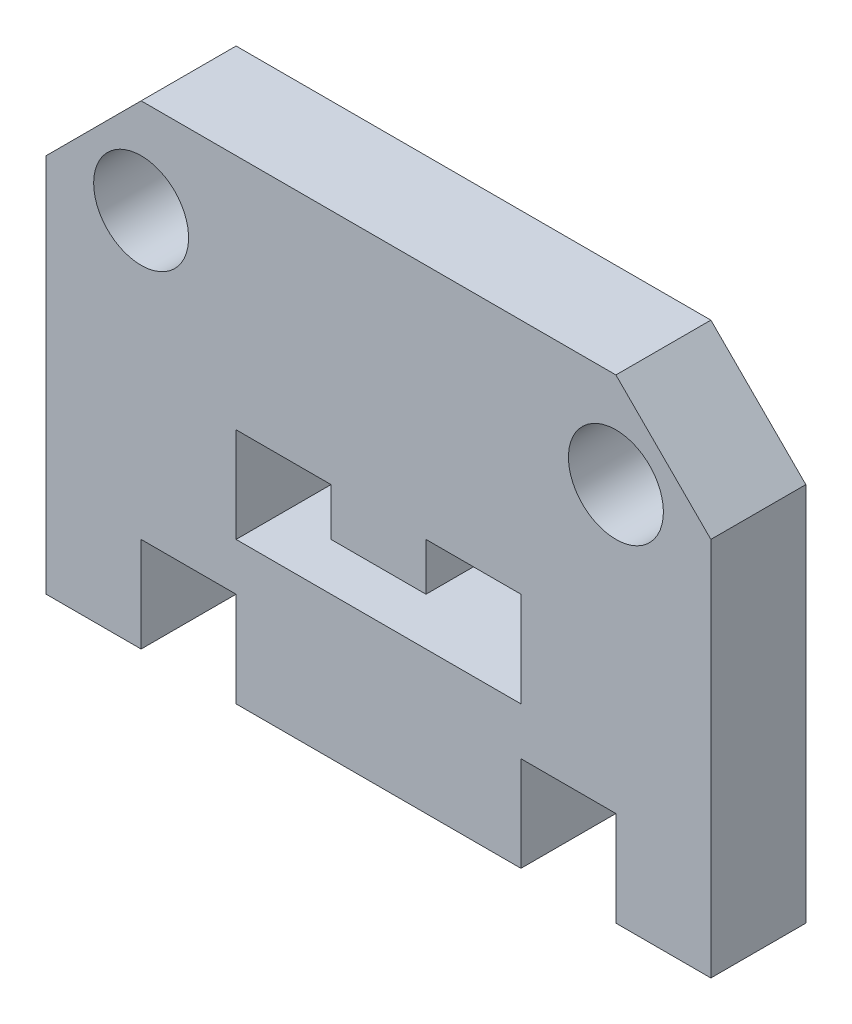
ISO-10303-21;
HEADER;
FILE_DESCRIPTION(('STEP AP214'),'2;1');
FILE_NAME('part.step','',(''),(''),'','','');
FILE_SCHEMA(('AUTOMOTIVE_DESIGN { 1 0 10303 214 1 1 1 1 }'));
ENDSEC;
DATA;
#1=APPLICATION_CONTEXT('core data for automotive mechanical design processes');
#2=APPLICATION_PROTOCOL_DEFINITION('international standard','automotive_design',2000,#1);
#3=PRODUCT_CONTEXT('',#1,'mechanical');
#4=PRODUCT('Part','Part','',(#3));
#5=PRODUCT_RELATED_PRODUCT_CATEGORY('part','',(#4));
#6=PRODUCT_DEFINITION_FORMATION('','',#4);
#7=PRODUCT_DEFINITION_CONTEXT('part definition',#1,'design');
#8=PRODUCT_DEFINITION('design','',#6,#7);
#9=PRODUCT_DEFINITION_SHAPE('','',#8);
#10=(LENGTH_UNIT() NAMED_UNIT(*) SI_UNIT(.MILLI.,.METRE.));
#11=(NAMED_UNIT(*) PLANE_ANGLE_UNIT() SI_UNIT($,.RADIAN.));
#12=(NAMED_UNIT(*) SI_UNIT($,.STERADIAN.) SOLID_ANGLE_UNIT());
#13=UNCERTAINTY_MEASURE_WITH_UNIT(LENGTH_MEASURE(1.E-05),#10,'distance_accuracy_value','');
#14=(GEOMETRIC_REPRESENTATION_CONTEXT(3) GLOBAL_UNCERTAINTY_ASSIGNED_CONTEXT((#13)) GLOBAL_UNIT_ASSIGNED_CONTEXT((#10,
#11,#12)) REPRESENTATION_CONTEXT('',''));
#15=CARTESIAN_POINT('',(0.,0.,0.));
#16=DIRECTION('',(0.,0.,1.));
#17=DIRECTION('',(1.,0.,0.));
#18=AXIS2_PLACEMENT_3D('',#15,#16,#17);
#19=CARTESIAN_POINT('',(0.,0.,10.));
#20=DIRECTION('',(0.,0.,1.));
#21=DIRECTION('',(1.,0.,0.));
#22=AXIS2_PLACEMENT_3D('',#19,#20,#21);
#23=PLANE('',#22);
#24=CARTESIAN_POINT('',(25.,40.,10.));
#25=DIRECTION('',(0.,0.,1.));
#26=DIRECTION('',(1.,0.,0.));
#27=AXIS2_PLACEMENT_3D('',#24,#25,#26);
#28=CIRCLE('',#27,5.);
#29=CARTESIAN_POINT('',(30.,40.,10.));
#30=VERTEX_POINT('',#29);
#31=EDGE_CURVE('E220',#30,#30,#28,.T.);
#32=ORIENTED_EDGE('',*,*,#31,.F.);
#33=EDGE_LOOP('',(#32));
#34=FACE_BOUND('',#33,.T.);
#35=DIRECTION('',(1.,0.,0.));
#36=VECTOR('',#35,1.);
#37=CARTESIAN_POINT('',(-15.,10.,10.));
#38=LINE('',#37,#36);
#39=CARTESIAN_POINT('',(-25.,10.,10.));
#40=VERTEX_POINT('',#39);
#41=CARTESIAN_POINT('',(-15.,10.,10.));
#42=VERTEX_POINT('',#41);
#43=EDGE_CURVE('E250',#40,#42,#38,.T.);
#44=ORIENTED_EDGE('',*,*,#43,.T.);
#45=DIRECTION('',(0.,-1.,0.));
#46=VECTOR('',#45,1.);
#47=CARTESIAN_POINT('',(-15.,0.,10.));
#48=LINE('',#47,#46);
#49=CARTESIAN_POINT('',(-15.,0.,10.));
#50=VERTEX_POINT('',#49);
#51=EDGE_CURVE('E253',#42,#50,#48,.T.);
#52=ORIENTED_EDGE('',*,*,#51,.T.);
#53=DIRECTION('',(1.,0.,0.));
#54=VECTOR('',#53,1.);
#55=CARTESIAN_POINT('',(-15.,0.,10.));
#56=LINE('',#55,#54);
#57=CARTESIAN_POINT('',(15.,0.,10.));
#58=VERTEX_POINT('',#57);
#59=EDGE_CURVE('E256',#50,#58,#56,.T.);
#60=ORIENTED_EDGE('',*,*,#59,.T.);
#61=DIRECTION('',(0.,1.,0.));
#62=VECTOR('',#61,1.);
#63=CARTESIAN_POINT('',(15.,0.,10.));
#64=LINE('',#63,#62);
#65=CARTESIAN_POINT('',(15.,10.,10.));
#66=VERTEX_POINT('',#65);
#67=EDGE_CURVE('E258',#58,#66,#64,.T.);
#68=ORIENTED_EDGE('',*,*,#67,.T.);
#69=DIRECTION('',(1.,0.,0.));
#70=VECTOR('',#69,1.);
#71=CARTESIAN_POINT('',(15.,10.,10.));
#72=LINE('',#71,#70);
#73=CARTESIAN_POINT('',(25.,10.,10.));
#74=VERTEX_POINT('',#73);
#75=EDGE_CURVE('E260',#66,#74,#72,.T.);
#76=ORIENTED_EDGE('',*,*,#75,.T.);
#77=DIRECTION('',(0.,-1.,0.));
#78=VECTOR('',#77,1.);
#79=CARTESIAN_POINT('',(25.,10.,10.));
#80=LINE('',#79,#78);
#81=CARTESIAN_POINT('',(25.,0.,10.));
#82=VERTEX_POINT('',#81);
#83=EDGE_CURVE('E262',#74,#82,#80,.T.);
#84=ORIENTED_EDGE('',*,*,#83,.T.);
#85=DIRECTION('',(1.,0.,0.));
#86=VECTOR('',#85,1.);
#87=CARTESIAN_POINT('',(25.,0.,10.));
#88=LINE('',#87,#86);
#89=CARTESIAN_POINT('',(35.,0.,10.));
#90=VERTEX_POINT('',#89);
#91=EDGE_CURVE('E264',#82,#90,#88,.T.);
#92=ORIENTED_EDGE('',*,*,#91,.T.);
#93=DIRECTION('',(0.,1.,0.));
#94=VECTOR('',#93,1.);
#95=CARTESIAN_POINT('',(35.,0.,10.));
#96=LINE('',#95,#94);
#97=CARTESIAN_POINT('',(35.,40.,10.));
#98=VERTEX_POINT('',#97);
#99=EDGE_CURVE('E266',#90,#98,#96,.T.);
#100=ORIENTED_EDGE('',*,*,#99,.T.);
#101=DIRECTION('',(-0.707106781186549,0.707106781186546,0.));
#102=VECTOR('',#101,1.);
#103=CARTESIAN_POINT('',(35.,40.,10.));
#104=LINE('',#103,#102);
#105=CARTESIAN_POINT('',(25.,50.,10.));
#106=VERTEX_POINT('',#105);
#107=EDGE_CURVE('E268',#98,#106,#104,.T.);
#108=ORIENTED_EDGE('',*,*,#107,.T.);
#109=DIRECTION('',(-1.,0.,0.));
#110=VECTOR('',#109,1.);
#111=CARTESIAN_POINT('',(25.,50.,10.));
#112=LINE('',#111,#110);
#113=CARTESIAN_POINT('',(-25.,50.,10.));
#114=VERTEX_POINT('',#113);
#115=EDGE_CURVE('E270',#106,#114,#112,.T.);
#116=ORIENTED_EDGE('',*,*,#115,.T.);
#117=DIRECTION('',(-0.707106781186549,-0.707106781186546,0.));
#118=VECTOR('',#117,1.);
#119=CARTESIAN_POINT('',(-35.,40.,10.));
#120=LINE('',#119,#118);
#121=CARTESIAN_POINT('',(-35.,40.,10.));
#122=VERTEX_POINT('',#121);
#123=EDGE_CURVE('E272',#114,#122,#120,.T.);
#124=ORIENTED_EDGE('',*,*,#123,.T.);
#125=DIRECTION('',(0.,-1.,0.));
#126=VECTOR('',#125,1.);
#127=CARTESIAN_POINT('',(-35.,0.,10.));
#128=LINE('',#127,#126);
#129=CARTESIAN_POINT('',(-35.,0.,10.));
#130=VERTEX_POINT('',#129);
#131=EDGE_CURVE('E274',#122,#130,#128,.T.);
#132=ORIENTED_EDGE('',*,*,#131,.T.);
#133=DIRECTION('',(1.,0.,0.));
#134=VECTOR('',#133,1.);
#135=CARTESIAN_POINT('',(-25.,0.,10.));
#136=LINE('',#135,#134);
#137=CARTESIAN_POINT('',(-25.,0.,10.));
#138=VERTEX_POINT('',#137);
#139=EDGE_CURVE('E276',#130,#138,#136,.T.);
#140=ORIENTED_EDGE('',*,*,#139,.T.);
#141=DIRECTION('',(0.,1.,0.));
#142=VECTOR('',#141,1.);
#143=CARTESIAN_POINT('',(-25.,10.,10.));
#144=LINE('',#143,#142);
#145=EDGE_CURVE('E278',#138,#40,#144,.T.);
#146=ORIENTED_EDGE('',*,*,#145,.T.);
#147=EDGE_LOOP('',(#44,#52,#60,#68,#76,#84,#92,#100,#108,#116,#124,#132,#140,#146));
#148=FACE_BOUND('',#147,.T.);
#149=DIRECTION('',(1.,0.,0.));
#150=VECTOR('',#149,1.);
#151=CARTESIAN_POINT('',(15.,15.,10.));
#152=LINE('',#151,#150);
#153=CARTESIAN_POINT('',(-15.,15.,10.));
#154=VERTEX_POINT('',#153);
#155=CARTESIAN_POINT('',(15.,15.,10.));
#156=VERTEX_POINT('',#155);
#157=EDGE_CURVE('E190',#154,#156,#152,.T.);
#158=ORIENTED_EDGE('',*,*,#157,.F.);
#159=DIRECTION('',(0.,-1.,0.));
#160=VECTOR('',#159,1.);
#161=CARTESIAN_POINT('',(-15.,25.,10.));
#162=LINE('',#161,#160);
#163=CARTESIAN_POINT('',(-15.,25.,10.));
#164=VERTEX_POINT('',#163);
#165=EDGE_CURVE('E182',#164,#154,#162,.T.);
#166=ORIENTED_EDGE('',*,*,#165,.F.);
#167=DIRECTION('',(-1.,0.,0.));
#168=VECTOR('',#167,1.);
#169=CARTESIAN_POINT('',(-5.,25.,10.));
#170=LINE('',#169,#168);
#171=CARTESIAN_POINT('',(-5.,25.,10.));
#172=VERTEX_POINT('',#171);
#173=EDGE_CURVE('E217',#172,#164,#170,.T.);
#174=ORIENTED_EDGE('',*,*,#173,.F.);
#175=DIRECTION('',(0.,1.,0.));
#176=VECTOR('',#175,1.);
#177=CARTESIAN_POINT('',(-4.99999999999999,20.,10.));
#178=LINE('',#177,#176);
#179=CARTESIAN_POINT('',(-4.99999999999999,20.,10.));
#180=VERTEX_POINT('',#179);
#181=EDGE_CURVE('E215',#180,#172,#178,.T.);
#182=ORIENTED_EDGE('',*,*,#181,.F.);
#183=DIRECTION('',(-1.,0.,0.));
#184=VECTOR('',#183,1.);
#185=CARTESIAN_POINT('',(-4.99999999999999,20.,10.));
#186=LINE('',#185,#184);
#187=CARTESIAN_POINT('',(5.,20.,10.));
#188=VERTEX_POINT('',#187);
#189=EDGE_CURVE('E213',#188,#180,#186,.T.);
#190=ORIENTED_EDGE('',*,*,#189,.F.);
#191=DIRECTION('',(0.,-1.,0.));
#192=VECTOR('',#191,1.);
#193=CARTESIAN_POINT('',(5.,20.,10.));
#194=LINE('',#193,#192);
#195=CARTESIAN_POINT('',(5.,25.,10.));
#196=VERTEX_POINT('',#195);
#197=EDGE_CURVE('E211',#196,#188,#194,.T.);
#198=ORIENTED_EDGE('',*,*,#197,.F.);
#199=DIRECTION('',(-1.,0.,0.));
#200=VECTOR('',#199,1.);
#201=CARTESIAN_POINT('',(5.,25.,10.));
#202=LINE('',#201,#200);
#203=CARTESIAN_POINT('',(15.,25.,10.));
#204=VERTEX_POINT('',#203);
#205=EDGE_CURVE('E206',#204,#196,#202,.T.);
#206=ORIENTED_EDGE('',*,*,#205,.F.);
#207=DIRECTION('',(0.,1.,0.));
#208=VECTOR('',#207,1.);
#209=CARTESIAN_POINT('',(15.,25.,10.));
#210=LINE('',#209,#208);
#211=EDGE_CURVE('E204',#156,#204,#210,.T.);
#212=ORIENTED_EDGE('',*,*,#211,.F.);
#213=EDGE_LOOP('',(#158,#166,#174,#182,#190,#198,#206,#212));
#214=FACE_BOUND('',#213,.T.);
#215=CARTESIAN_POINT('',(-25.,40.,10.));
#216=DIRECTION('',(0.,0.,1.));
#217=DIRECTION('',(-1.,0.,0.));
#218=AXIS2_PLACEMENT_3D('',#215,#216,#217);
#219=CIRCLE('',#218,5.);
#220=CARTESIAN_POINT('',(-30.,40.,10.));
#221=VERTEX_POINT('',#220);
#222=EDGE_CURVE('E640',#221,#221,#219,.T.);
#223=ORIENTED_EDGE('',*,*,#222,.F.);
#224=EDGE_LOOP('',(#223));
#225=FACE_BOUND('',#224,.T.);
#226=ADVANCED_FACE('F33',(#34,#148,#214,#225),#23,.T.);
#227=CARTESIAN_POINT('',(0.,0.,0.));
#228=DIRECTION('',(0.,0.,1.));
#229=DIRECTION('',(1.,0.,0.));
#230=AXIS2_PLACEMENT_3D('',#227,#228,#229);
#231=PLANE('',#230);
#232=DIRECTION('',(1.,0.,0.));
#233=VECTOR('',#232,1.);
#234=CARTESIAN_POINT('',(-15.,10.,0.));
#235=LINE('',#234,#233);
#236=CARTESIAN_POINT('',(-25.,10.,0.));
#237=VERTEX_POINT('',#236);
#238=CARTESIAN_POINT('',(-15.,10.,0.));
#239=VERTEX_POINT('',#238);
#240=EDGE_CURVE('E198',#237,#239,#235,.T.);
#241=ORIENTED_EDGE('',*,*,#240,.F.);
#242=DIRECTION('',(0.,1.,0.));
#243=VECTOR('',#242,1.);
#244=CARTESIAN_POINT('',(-25.,10.,0.));
#245=LINE('',#244,#243);
#246=CARTESIAN_POINT('',(-25.,0.,0.));
#247=VERTEX_POINT('',#246);
#248=EDGE_CURVE('E254',#247,#237,#245,.T.);
#249=ORIENTED_EDGE('',*,*,#248,.F.);
#250=DIRECTION('',(1.,0.,0.));
#251=VECTOR('',#250,1.);
#252=CARTESIAN_POINT('',(-25.,0.,0.));
#253=LINE('',#252,#251);
#254=CARTESIAN_POINT('',(-35.,0.,0.));
#255=VERTEX_POINT('',#254);
#256=EDGE_CURVE('E305',#255,#247,#253,.T.);
#257=ORIENTED_EDGE('',*,*,#256,.F.);
#258=DIRECTION('',(0.,-1.,0.));
#259=VECTOR('',#258,1.);
#260=CARTESIAN_POINT('',(-35.,0.,0.));
#261=LINE('',#260,#259);
#262=CARTESIAN_POINT('',(-35.,40.,0.));
#263=VERTEX_POINT('',#262);
#264=EDGE_CURVE('E303',#263,#255,#261,.T.);
#265=ORIENTED_EDGE('',*,*,#264,.F.);
#266=DIRECTION('',(-0.707106781186549,-0.707106781186546,0.));
#267=VECTOR('',#266,1.);
#268=CARTESIAN_POINT('',(-35.,40.,0.));
#269=LINE('',#268,#267);
#270=CARTESIAN_POINT('',(-25.,50.,0.));
#271=VERTEX_POINT('',#270);
#272=EDGE_CURVE('E301',#271,#263,#269,.T.);
#273=ORIENTED_EDGE('',*,*,#272,.F.);
#274=DIRECTION('',(-1.,0.,0.));
#275=VECTOR('',#274,1.);
#276=CARTESIAN_POINT('',(25.,50.,0.));
#277=LINE('',#276,#275);
#278=CARTESIAN_POINT('',(25.,50.,0.));
#279=VERTEX_POINT('',#278);
#280=EDGE_CURVE('E299',#279,#271,#277,.T.);
#281=ORIENTED_EDGE('',*,*,#280,.F.);
#282=DIRECTION('',(-0.707106781186549,0.707106781186546,0.));
#283=VECTOR('',#282,1.);
#284=CARTESIAN_POINT('',(35.,40.,0.));
#285=LINE('',#284,#283);
#286=CARTESIAN_POINT('',(35.,40.,0.));
#287=VERTEX_POINT('',#286);
#288=EDGE_CURVE('E297',#287,#279,#285,.T.);
#289=ORIENTED_EDGE('',*,*,#288,.F.);
#290=DIRECTION('',(0.,1.,0.));
#291=VECTOR('',#290,1.);
#292=CARTESIAN_POINT('',(35.,0.,0.));
#293=LINE('',#292,#291);
#294=CARTESIAN_POINT('',(35.,0.,0.));
#295=VERTEX_POINT('',#294);
#296=EDGE_CURVE('E295',#295,#287,#293,.T.);
#297=ORIENTED_EDGE('',*,*,#296,.F.);
#298=DIRECTION('',(1.,0.,0.));
#299=VECTOR('',#298,1.);
#300=CARTESIAN_POINT('',(25.,0.,0.));
#301=LINE('',#300,#299);
#302=CARTESIAN_POINT('',(25.,0.,0.));
#303=VERTEX_POINT('',#302);
#304=EDGE_CURVE('E293',#303,#295,#301,.T.);
#305=ORIENTED_EDGE('',*,*,#304,.F.);
#306=DIRECTION('',(0.,-1.,0.));
#307=VECTOR('',#306,1.);
#308=CARTESIAN_POINT('',(25.,10.,0.));
#309=LINE('',#308,#307);
#310=CARTESIAN_POINT('',(25.,10.,0.));
#311=VERTEX_POINT('',#310);
#312=EDGE_CURVE('E291',#311,#303,#309,.T.);
#313=ORIENTED_EDGE('',*,*,#312,.F.);
#314=DIRECTION('',(1.,0.,0.));
#315=VECTOR('',#314,1.);
#316=CARTESIAN_POINT('',(15.,10.,0.));
#317=LINE('',#316,#315);
#318=CARTESIAN_POINT('',(15.,10.,0.));
#319=VERTEX_POINT('',#318);
#320=EDGE_CURVE('E289',#319,#311,#317,.T.);
#321=ORIENTED_EDGE('',*,*,#320,.F.);
#322=DIRECTION('',(0.,1.,0.));
#323=VECTOR('',#322,1.);
#324=CARTESIAN_POINT('',(15.,0.,0.));
#325=LINE('',#324,#323);
#326=CARTESIAN_POINT('',(15.,0.,0.));
#327=VERTEX_POINT('',#326);
#328=EDGE_CURVE('E287',#327,#319,#325,.T.);
#329=ORIENTED_EDGE('',*,*,#328,.F.);
#330=DIRECTION('',(1.,0.,0.));
#331=VECTOR('',#330,1.);
#332=CARTESIAN_POINT('',(-15.,0.,0.));
#333=LINE('',#332,#331);
#334=CARTESIAN_POINT('',(-15.,0.,0.));
#335=VERTEX_POINT('',#334);
#336=EDGE_CURVE('E285',#335,#327,#333,.T.);
#337=ORIENTED_EDGE('',*,*,#336,.F.);
#338=DIRECTION('',(0.,-1.,0.));
#339=VECTOR('',#338,1.);
#340=CARTESIAN_POINT('',(-15.,0.,0.));
#341=LINE('',#340,#339);
#342=EDGE_CURVE('E283',#239,#335,#341,.T.);
#343=ORIENTED_EDGE('',*,*,#342,.F.);
#344=EDGE_LOOP('',(#241,#249,#257,#265,#273,#281,#289,#297,#305,#313,#321,#329,#337,#343));
#345=FACE_BOUND('',#344,.T.);
#346=DIRECTION('',(0.,-1.,0.));
#347=VECTOR('',#346,1.);
#348=CARTESIAN_POINT('',(-15.,25.,0.));
#349=LINE('',#348,#347);
#350=CARTESIAN_POINT('',(-15.,25.,0.));
#351=VERTEX_POINT('',#350);
#352=CARTESIAN_POINT('',(-15.,15.,0.));
#353=VERTEX_POINT('',#352);
#354=EDGE_CURVE('E56',#351,#353,#349,.T.);
#355=ORIENTED_EDGE('',*,*,#354,.T.);
#356=DIRECTION('',(1.,0.,0.));
#357=VECTOR('',#356,1.);
#358=CARTESIAN_POINT('',(15.,15.,0.));
#359=LINE('',#358,#357);
#360=CARTESIAN_POINT('',(15.,15.,0.));
#361=VERTEX_POINT('',#360);
#362=EDGE_CURVE('E197',#353,#361,#359,.T.);
#363=ORIENTED_EDGE('',*,*,#362,.T.);
#364=DIRECTION('',(0.,1.,0.));
#365=VECTOR('',#364,1.);
#366=CARTESIAN_POINT('',(15.,25.,0.));
#367=LINE('',#366,#365);
#368=CARTESIAN_POINT('',(15.,25.,0.));
#369=VERTEX_POINT('',#368);
#370=EDGE_CURVE('E222',#361,#369,#367,.T.);
#371=ORIENTED_EDGE('',*,*,#370,.T.);
#372=DIRECTION('',(-1.,0.,0.));
#373=VECTOR('',#372,1.);
#374=CARTESIAN_POINT('',(5.,25.,0.));
#375=LINE('',#374,#373);
#376=CARTESIAN_POINT('',(5.,25.,0.));
#377=VERTEX_POINT('',#376);
#378=EDGE_CURVE('E225',#369,#377,#375,.T.);
#379=ORIENTED_EDGE('',*,*,#378,.T.);
#380=DIRECTION('',(0.,-1.,0.));
#381=VECTOR('',#380,1.);
#382=CARTESIAN_POINT('',(5.,20.,0.));
#383=LINE('',#382,#381);
#384=CARTESIAN_POINT('',(5.,20.,0.));
#385=VERTEX_POINT('',#384);
#386=EDGE_CURVE('E228',#377,#385,#383,.T.);
#387=ORIENTED_EDGE('',*,*,#386,.T.);
#388=DIRECTION('',(-1.,0.,0.));
#389=VECTOR('',#388,1.);
#390=CARTESIAN_POINT('',(-4.99999999999999,20.,0.));
#391=LINE('',#390,#389);
#392=CARTESIAN_POINT('',(-4.99999999999999,20.,0.));
#393=VERTEX_POINT('',#392);
#394=EDGE_CURVE('E231',#385,#393,#391,.T.);
#395=ORIENTED_EDGE('',*,*,#394,.T.);
#396=DIRECTION('',(0.,1.,0.));
#397=VECTOR('',#396,1.);
#398=CARTESIAN_POINT('',(-4.99999999999999,20.,0.));
#399=LINE('',#398,#397);
#400=CARTESIAN_POINT('',(-5.,25.,0.));
#401=VERTEX_POINT('',#400);
#402=EDGE_CURVE('E234',#393,#401,#399,.T.);
#403=ORIENTED_EDGE('',*,*,#402,.T.);
#404=DIRECTION('',(-1.,0.,0.));
#405=VECTOR('',#404,1.);
#406=CARTESIAN_POINT('',(-5.,25.,0.));
#407=LINE('',#406,#405);
#408=EDGE_CURVE('E191',#401,#351,#407,.T.);
#409=ORIENTED_EDGE('',*,*,#408,.T.);
#410=EDGE_LOOP('',(#355,#363,#371,#379,#387,#395,#403,#409));
#411=FACE_BOUND('',#410,.T.);
#412=CARTESIAN_POINT('',(25.,40.,0.));
#413=DIRECTION('',(0.,0.,1.));
#414=DIRECTION('',(1.,0.,0.));
#415=AXIS2_PLACEMENT_3D('',#412,#413,#414);
#416=CIRCLE('',#415,5.);
#417=CARTESIAN_POINT('',(30.,40.,0.));
#418=VERTEX_POINT('',#417);
#419=EDGE_CURVE('E646',#418,#418,#416,.T.);
#420=ORIENTED_EDGE('',*,*,#419,.T.);
#421=EDGE_LOOP('',(#420));
#422=FACE_BOUND('',#421,.T.);
#423=CARTESIAN_POINT('',(-25.,40.,0.));
#424=DIRECTION('',(0.,0.,1.));
#425=DIRECTION('',(-1.,0.,0.));
#426=AXIS2_PLACEMENT_3D('',#423,#424,#425);
#427=CIRCLE('',#426,5.);
#428=CARTESIAN_POINT('',(-30.,40.,0.));
#429=VERTEX_POINT('',#428);
#430=EDGE_CURVE('E643',#429,#429,#427,.T.);
#431=ORIENTED_EDGE('',*,*,#430,.T.);
#432=EDGE_LOOP('',(#431));
#433=FACE_BOUND('',#432,.T.);
#434=ADVANCED_FACE('F353',(#345,#411,#422,#433),#231,.F.);
#435=CARTESIAN_POINT('',(-15.,10.,10.));
#436=DIRECTION('',(0.,1.,0.));
#437=DIRECTION('',(0.,0.,1.));
#438=AXIS2_PLACEMENT_3D('',#435,#436,#437);
#439=PLANE('',#438);
#440=ORIENTED_EDGE('',*,*,#240,.T.);
#441=DIRECTION('',(0.,0.,-1.));
#442=VECTOR('',#441,1.);
#443=CARTESIAN_POINT('',(-15.,10.,10.));
#444=LINE('',#443,#442);
#445=EDGE_CURVE('E11',#42,#239,#444,.T.);
#446=ORIENTED_EDGE('',*,*,#445,.F.);
#447=ORIENTED_EDGE('',*,*,#43,.F.);
#448=DIRECTION('',(0.,0.,-1.));
#449=VECTOR('',#448,1.);
#450=CARTESIAN_POINT('',(-25.,10.,10.));
#451=LINE('',#450,#449);
#452=EDGE_CURVE('E280',#40,#237,#451,.T.);
#453=ORIENTED_EDGE('',*,*,#452,.T.);
#454=EDGE_LOOP('',(#440,#446,#447,#453));
#455=FACE_BOUND('',#454,.T.);
#456=ADVANCED_FACE('F35',(#455),#439,.F.);
#457=CARTESIAN_POINT('',(-15.,0.,10.));
#458=DIRECTION('',(1.,0.,0.));
#459=DIRECTION('',(0.,0.,-1.));
#460=AXIS2_PLACEMENT_3D('',#457,#458,#459);
#461=PLANE('',#460);
#462=ORIENTED_EDGE('',*,*,#342,.T.);
#463=DIRECTION('',(0.,0.,-1.));
#464=VECTOR('',#463,1.);
#465=CARTESIAN_POINT('',(-15.,0.,10.));
#466=LINE('',#465,#464);
#467=EDGE_CURVE('E41',#50,#335,#466,.T.);
#468=ORIENTED_EDGE('',*,*,#467,.F.);
#469=ORIENTED_EDGE('',*,*,#51,.F.);
#470=ORIENTED_EDGE('',*,*,#445,.T.);
#471=EDGE_LOOP('',(#462,#468,#469,#470));
#472=FACE_BOUND('',#471,.T.);
#473=ADVANCED_FACE('F370',(#472),#461,.F.);
#474=CARTESIAN_POINT('',(-15.,0.,10.));
#475=DIRECTION('',(0.,1.,0.));
#476=DIRECTION('',(-1.,0.,0.));
#477=AXIS2_PLACEMENT_3D('',#474,#475,#476);
#478=PLANE('',#477);
#479=ORIENTED_EDGE('',*,*,#336,.T.);
#480=DIRECTION('',(0.,0.,-1.));
#481=VECTOR('',#480,1.);
#482=CARTESIAN_POINT('',(15.,0.,10.));
#483=LINE('',#482,#481);
#484=EDGE_CURVE('E340',#58,#327,#483,.T.);
#485=ORIENTED_EDGE('',*,*,#484,.F.);
#486=ORIENTED_EDGE('',*,*,#59,.F.);
#487=ORIENTED_EDGE('',*,*,#467,.T.);
#488=EDGE_LOOP('',(#479,#485,#486,#487));
#489=FACE_BOUND('',#488,.T.);
#490=ADVANCED_FACE('F347',(#489),#478,.F.);
#491=CARTESIAN_POINT('',(15.,0.,10.));
#492=DIRECTION('',(-1.,0.,0.));
#493=DIRECTION('',(0.,-1.,0.));
#494=AXIS2_PLACEMENT_3D('',#491,#492,#493);
#495=PLANE('',#494);
#496=ORIENTED_EDGE('',*,*,#328,.T.);
#497=DIRECTION('',(0.,0.,-1.));
#498=VECTOR('',#497,1.);
#499=CARTESIAN_POINT('',(15.,10.,10.));
#500=LINE('',#499,#498);
#501=EDGE_CURVE('E337',#66,#319,#500,.T.);
#502=ORIENTED_EDGE('',*,*,#501,.F.);
#503=ORIENTED_EDGE('',*,*,#67,.F.);
#504=ORIENTED_EDGE('',*,*,#484,.T.);
#505=EDGE_LOOP('',(#496,#502,#503,#504));
#506=FACE_BOUND('',#505,.T.);
#507=ADVANCED_FACE('F359',(#506),#495,.F.);
#508=CARTESIAN_POINT('',(15.,10.,10.));
#509=DIRECTION('',(0.,1.,0.));
#510=DIRECTION('',(0.,0.,1.));
#511=AXIS2_PLACEMENT_3D('',#508,#509,#510);
#512=PLANE('',#511);
#513=ORIENTED_EDGE('',*,*,#320,.T.);
#514=DIRECTION('',(0.,0.,-1.));
#515=VECTOR('',#514,1.);
#516=CARTESIAN_POINT('',(25.,10.,10.));
#517=LINE('',#516,#515);
#518=EDGE_CURVE('E334',#74,#311,#517,.T.);
#519=ORIENTED_EDGE('',*,*,#518,.F.);
#520=ORIENTED_EDGE('',*,*,#75,.F.);
#521=ORIENTED_EDGE('',*,*,#501,.T.);
#522=EDGE_LOOP('',(#513,#519,#520,#521));
#523=FACE_BOUND('',#522,.T.);
#524=ADVANCED_FACE('F363',(#523),#512,.F.);
#525=CARTESIAN_POINT('',(25.,10.,10.));
#526=DIRECTION('',(1.,0.,0.));
#527=DIRECTION('',(0.,0.,-1.));
#528=AXIS2_PLACEMENT_3D('',#525,#526,#527);
#529=PLANE('',#528);
#530=ORIENTED_EDGE('',*,*,#312,.T.);
#531=DIRECTION('',(0.,0.,-1.));
#532=VECTOR('',#531,1.);
#533=CARTESIAN_POINT('',(25.,0.,10.));
#534=LINE('',#533,#532);
#535=EDGE_CURVE('E331',#82,#303,#534,.T.);
#536=ORIENTED_EDGE('',*,*,#535,.F.);
#537=ORIENTED_EDGE('',*,*,#83,.F.);
#538=ORIENTED_EDGE('',*,*,#518,.T.);
#539=EDGE_LOOP('',(#530,#536,#537,#538));
#540=FACE_BOUND('',#539,.T.);
#541=ADVANCED_FACE('F413',(#540),#529,.F.);
#542=CARTESIAN_POINT('',(25.,0.,10.));
#543=DIRECTION('',(0.,1.,0.));
#544=DIRECTION('',(0.,0.,1.));
#545=AXIS2_PLACEMENT_3D('',#542,#543,#544);
#546=PLANE('',#545);
#547=ORIENTED_EDGE('',*,*,#304,.T.);
#548=DIRECTION('',(0.,0.,-1.));
#549=VECTOR('',#548,1.);
#550=CARTESIAN_POINT('',(35.,0.,10.));
#551=LINE('',#550,#549);
#552=EDGE_CURVE('E328',#90,#295,#551,.T.);
#553=ORIENTED_EDGE('',*,*,#552,.F.);
#554=ORIENTED_EDGE('',*,*,#91,.F.);
#555=ORIENTED_EDGE('',*,*,#535,.T.);
#556=EDGE_LOOP('',(#547,#553,#554,#555));
#557=FACE_BOUND('',#556,.T.);
#558=ADVANCED_FACE('F411',(#557),#546,.F.);
#559=CARTESIAN_POINT('',(35.,0.,10.));
#560=DIRECTION('',(-1.,0.,0.));
#561=DIRECTION('',(0.,0.,1.));
#562=AXIS2_PLACEMENT_3D('',#559,#560,#561);
#563=PLANE('',#562);
#564=ORIENTED_EDGE('',*,*,#296,.T.);
#565=DIRECTION('',(0.,0.,-1.));
#566=VECTOR('',#565,1.);
#567=CARTESIAN_POINT('',(35.,40.,10.));
#568=LINE('',#567,#566);
#569=EDGE_CURVE('E325',#98,#287,#568,.T.);
#570=ORIENTED_EDGE('',*,*,#569,.F.);
#571=ORIENTED_EDGE('',*,*,#99,.F.);
#572=ORIENTED_EDGE('',*,*,#552,.T.);
#573=EDGE_LOOP('',(#564,#570,#571,#572));
#574=FACE_BOUND('',#573,.T.);
#575=ADVANCED_FACE('F406',(#574),#563,.F.);
#576=CARTESIAN_POINT('',(35.,40.,10.));
#577=DIRECTION('',(-0.707106781186546,-0.707106781186549,0.));
#578=DIRECTION('',(0.707106781186549,-0.707106781186546,0.));
#579=AXIS2_PLACEMENT_3D('',#576,#577,#578);
#580=PLANE('',#579);
#581=ORIENTED_EDGE('',*,*,#288,.T.);
#582=DIRECTION('',(0.,0.,-1.));
#583=VECTOR('',#582,1.);
#584=CARTESIAN_POINT('',(25.,50.,10.));
#585=LINE('',#584,#583);
#586=EDGE_CURVE('E322',#106,#279,#585,.T.);
#587=ORIENTED_EDGE('',*,*,#586,.F.);
#588=ORIENTED_EDGE('',*,*,#107,.F.);
#589=ORIENTED_EDGE('',*,*,#569,.T.);
#590=EDGE_LOOP('',(#581,#587,#588,#589));
#591=FACE_BOUND('',#590,.T.);
#592=ADVANCED_FACE('F401',(#591),#580,.F.);
#593=CARTESIAN_POINT('',(25.,50.,10.));
#594=DIRECTION('',(0.,-1.,0.));
#595=DIRECTION('',(0.,0.,-1.));
#596=AXIS2_PLACEMENT_3D('',#593,#594,#595);
#597=PLANE('',#596);
#598=ORIENTED_EDGE('',*,*,#280,.T.);
#599=DIRECTION('',(0.,0.,-1.));
#600=VECTOR('',#599,1.);
#601=CARTESIAN_POINT('',(-25.,50.,10.));
#602=LINE('',#601,#600);
#603=EDGE_CURVE('E319',#114,#271,#602,.T.);
#604=ORIENTED_EDGE('',*,*,#603,.F.);
#605=ORIENTED_EDGE('',*,*,#115,.F.);
#606=ORIENTED_EDGE('',*,*,#586,.T.);
#607=EDGE_LOOP('',(#598,#604,#605,#606));
#608=FACE_BOUND('',#607,.T.);
#609=ADVANCED_FACE('F397',(#608),#597,.F.);
#610=CARTESIAN_POINT('',(-35.,40.,10.));
#611=DIRECTION('',(0.707106781186546,-0.707106781186549,0.));
#612=DIRECTION('',(0.707106781186549,0.707106781186546,0.));
#613=AXIS2_PLACEMENT_3D('',#610,#611,#612);
#614=PLANE('',#613);
#615=ORIENTED_EDGE('',*,*,#272,.T.);
#616=DIRECTION('',(0.,0.,-1.));
#617=VECTOR('',#616,1.);
#618=CARTESIAN_POINT('',(-35.,40.,10.));
#619=LINE('',#618,#617);
#620=EDGE_CURVE('E316',#122,#263,#619,.T.);
#621=ORIENTED_EDGE('',*,*,#620,.F.);
#622=ORIENTED_EDGE('',*,*,#123,.F.);
#623=ORIENTED_EDGE('',*,*,#603,.T.);
#624=EDGE_LOOP('',(#615,#621,#622,#623));
#625=FACE_BOUND('',#624,.T.);
#626=ADVANCED_FACE('F392',(#625),#614,.F.);
#627=CARTESIAN_POINT('',(-35.,0.,10.));
#628=DIRECTION('',(1.,0.,0.));
#629=DIRECTION('',(0.,1.,0.));
#630=AXIS2_PLACEMENT_3D('',#627,#628,#629);
#631=PLANE('',#630);
#632=ORIENTED_EDGE('',*,*,#264,.T.);
#633=DIRECTION('',(0.,0.,-1.));
#634=VECTOR('',#633,1.);
#635=CARTESIAN_POINT('',(-35.,0.,10.));
#636=LINE('',#635,#634);
#637=EDGE_CURVE('E313',#130,#255,#636,.T.);
#638=ORIENTED_EDGE('',*,*,#637,.F.);
#639=ORIENTED_EDGE('',*,*,#131,.F.);
#640=ORIENTED_EDGE('',*,*,#620,.T.);
#641=EDGE_LOOP('',(#632,#638,#639,#640));
#642=FACE_BOUND('',#641,.T.);
#643=ADVANCED_FACE('F386',(#642),#631,.F.);
#644=CARTESIAN_POINT('',(-25.,0.,10.));
#645=DIRECTION('',(0.,1.,0.));
#646=DIRECTION('',(0.,0.,1.));
#647=AXIS2_PLACEMENT_3D('',#644,#645,#646);
#648=PLANE('',#647);
#649=ORIENTED_EDGE('',*,*,#256,.T.);
#650=DIRECTION('',(0.,0.,-1.));
#651=VECTOR('',#650,1.);
#652=CARTESIAN_POINT('',(-25.,0.,10.));
#653=LINE('',#652,#651);
#654=EDGE_CURVE('E310',#138,#247,#653,.T.);
#655=ORIENTED_EDGE('',*,*,#654,.F.);
#656=ORIENTED_EDGE('',*,*,#139,.F.);
#657=ORIENTED_EDGE('',*,*,#637,.T.);
#658=EDGE_LOOP('',(#649,#655,#656,#657));
#659=FACE_BOUND('',#658,.T.);
#660=ADVANCED_FACE('F382',(#659),#648,.F.);
#661=CARTESIAN_POINT('',(-25.,10.,10.));
#662=DIRECTION('',(-1.,0.,0.));
#663=DIRECTION('',(0.,0.,1.));
#664=AXIS2_PLACEMENT_3D('',#661,#662,#663);
#665=PLANE('',#664);
#666=ORIENTED_EDGE('',*,*,#248,.T.);
#667=ORIENTED_EDGE('',*,*,#452,.F.);
#668=ORIENTED_EDGE('',*,*,#145,.F.);
#669=ORIENTED_EDGE('',*,*,#654,.T.);
#670=EDGE_LOOP('',(#666,#667,#668,#669));
#671=FACE_BOUND('',#670,.T.);
#672=ADVANCED_FACE('F377',(#671),#665,.F.);
#673=CARTESIAN_POINT('',(-15.,25.,10.));
#674=DIRECTION('',(1.,0.,0.));
#675=DIRECTION('',(0.,1.,0.));
#676=AXIS2_PLACEMENT_3D('',#673,#674,#675);
#677=PLANE('',#676);
#678=ORIENTED_EDGE('',*,*,#354,.F.);
#679=DIRECTION('',(0.,0.,-1.));
#680=VECTOR('',#679,1.);
#681=CARTESIAN_POINT('',(-15.,25.,10.));
#682=LINE('',#681,#680);
#683=EDGE_CURVE('E186',#164,#351,#682,.T.);
#684=ORIENTED_EDGE('',*,*,#683,.F.);
#685=ORIENTED_EDGE('',*,*,#165,.T.);
#686=DIRECTION('',(0.,0.,-1.));
#687=VECTOR('',#686,1.);
#688=CARTESIAN_POINT('',(-15.,15.,10.));
#689=LINE('',#688,#687);
#690=EDGE_CURVE('E185',#154,#353,#689,.T.);
#691=ORIENTED_EDGE('',*,*,#690,.T.);
#692=EDGE_LOOP('',(#678,#684,#685,#691));
#693=FACE_BOUND('',#692,.T.);
#694=ADVANCED_FACE('F184',(#693),#677,.T.);
#695=CARTESIAN_POINT('',(15.,15.,10.));
#696=DIRECTION('',(0.,1.,0.));
#697=DIRECTION('',(0.,0.,1.));
#698=AXIS2_PLACEMENT_3D('',#695,#696,#697);
#699=PLANE('',#698);
#700=ORIENTED_EDGE('',*,*,#362,.F.);
#701=ORIENTED_EDGE('',*,*,#690,.F.);
#702=ORIENTED_EDGE('',*,*,#157,.T.);
#703=DIRECTION('',(0.,0.,-1.));
#704=VECTOR('',#703,1.);
#705=CARTESIAN_POINT('',(15.,15.,10.));
#706=LINE('',#705,#704);
#707=EDGE_CURVE('E199',#156,#361,#706,.T.);
#708=ORIENTED_EDGE('',*,*,#707,.T.);
#709=EDGE_LOOP('',(#700,#701,#702,#708));
#710=FACE_BOUND('',#709,.T.);
#711=ADVANCED_FACE('F194',(#710),#699,.T.);
#712=CARTESIAN_POINT('',(15.,25.,10.));
#713=DIRECTION('',(-1.,0.,0.));
#714=DIRECTION('',(0.,0.,1.));
#715=AXIS2_PLACEMENT_3D('',#712,#713,#714);
#716=PLANE('',#715);
#717=ORIENTED_EDGE('',*,*,#370,.F.);
#718=ORIENTED_EDGE('',*,*,#707,.F.);
#719=ORIENTED_EDGE('',*,*,#211,.T.);
#720=DIRECTION('',(0.,0.,-1.));
#721=VECTOR('',#720,1.);
#722=CARTESIAN_POINT('',(15.,25.,10.));
#723=LINE('',#722,#721);
#724=EDGE_CURVE('E247',#204,#369,#723,.T.);
#725=ORIENTED_EDGE('',*,*,#724,.T.);
#726=EDGE_LOOP('',(#717,#718,#719,#725));
#727=FACE_BOUND('',#726,.T.);
#728=ADVANCED_FACE('F485',(#727),#716,.T.);
#729=CARTESIAN_POINT('',(5.,25.,10.));
#730=DIRECTION('',(0.,-1.,0.));
#731=DIRECTION('',(1.,0.,0.));
#732=AXIS2_PLACEMENT_3D('',#729,#730,#731);
#733=PLANE('',#732);
#734=ORIENTED_EDGE('',*,*,#378,.F.);
#735=ORIENTED_EDGE('',*,*,#724,.F.);
#736=ORIENTED_EDGE('',*,*,#205,.T.);
#737=DIRECTION('',(0.,0.,-1.));
#738=VECTOR('',#737,1.);
#739=CARTESIAN_POINT('',(5.,25.,10.));
#740=LINE('',#739,#738);
#741=EDGE_CURVE('E245',#196,#377,#740,.T.);
#742=ORIENTED_EDGE('',*,*,#741,.T.);
#743=EDGE_LOOP('',(#734,#735,#736,#742));
#744=FACE_BOUND('',#743,.T.);
#745=ADVANCED_FACE('F491',(#744),#733,.T.);
#746=CARTESIAN_POINT('',(5.,20.,10.));
#747=DIRECTION('',(1.,0.,0.));
#748=DIRECTION('',(0.,0.,-1.));
#749=AXIS2_PLACEMENT_3D('',#746,#747,#748);
#750=PLANE('',#749);
#751=ORIENTED_EDGE('',*,*,#386,.F.);
#752=ORIENTED_EDGE('',*,*,#741,.F.);
#753=ORIENTED_EDGE('',*,*,#197,.T.);
#754=DIRECTION('',(0.,0.,-1.));
#755=VECTOR('',#754,1.);
#756=CARTESIAN_POINT('',(5.,20.,10.));
#757=LINE('',#756,#755);
#758=EDGE_CURVE('E243',#188,#385,#757,.T.);
#759=ORIENTED_EDGE('',*,*,#758,.T.);
#760=EDGE_LOOP('',(#751,#752,#753,#759));
#761=FACE_BOUND('',#760,.T.);
#762=ADVANCED_FACE('F499',(#761),#750,.T.);
#763=CARTESIAN_POINT('',(-4.99999999999999,20.,10.));
#764=DIRECTION('',(0.,-1.,0.));
#765=DIRECTION('',(0.,0.,-1.));
#766=AXIS2_PLACEMENT_3D('',#763,#764,#765);
#767=PLANE('',#766);
#768=ORIENTED_EDGE('',*,*,#394,.F.);
#769=ORIENTED_EDGE('',*,*,#758,.F.);
#770=ORIENTED_EDGE('',*,*,#189,.T.);
#771=DIRECTION('',(0.,0.,-1.));
#772=VECTOR('',#771,1.);
#773=CARTESIAN_POINT('',(-4.99999999999999,20.,10.));
#774=LINE('',#773,#772);
#775=EDGE_CURVE('E241',#180,#393,#774,.T.);
#776=ORIENTED_EDGE('',*,*,#775,.T.);
#777=EDGE_LOOP('',(#768,#769,#770,#776));
#778=FACE_BOUND('',#777,.T.);
#779=ADVANCED_FACE('F507',(#778),#767,.T.);
#780=CARTESIAN_POINT('',(-4.99999999999999,20.,10.));
#781=DIRECTION('',(-1.,0.,0.));
#782=DIRECTION('',(0.,-1.,0.));
#783=AXIS2_PLACEMENT_3D('',#780,#781,#782);
#784=PLANE('',#783);
#785=ORIENTED_EDGE('',*,*,#402,.F.);
#786=ORIENTED_EDGE('',*,*,#775,.F.);
#787=ORIENTED_EDGE('',*,*,#181,.T.);
#788=DIRECTION('',(0.,0.,-1.));
#789=VECTOR('',#788,1.);
#790=CARTESIAN_POINT('',(-5.,25.,10.));
#791=LINE('',#790,#789);
#792=EDGE_CURVE('E48',#172,#401,#791,.T.);
#793=ORIENTED_EDGE('',*,*,#792,.T.);
#794=EDGE_LOOP('',(#785,#786,#787,#793));
#795=FACE_BOUND('',#794,.T.);
#796=ADVANCED_FACE('F515',(#795),#784,.T.);
#797=CARTESIAN_POINT('',(-5.,25.,10.));
#798=DIRECTION('',(0.,-1.,0.));
#799=DIRECTION('',(1.,0.,0.));
#800=AXIS2_PLACEMENT_3D('',#797,#798,#799);
#801=PLANE('',#800);
#802=ORIENTED_EDGE('',*,*,#408,.F.);
#803=ORIENTED_EDGE('',*,*,#792,.F.);
#804=ORIENTED_EDGE('',*,*,#173,.T.);
#805=ORIENTED_EDGE('',*,*,#683,.T.);
#806=EDGE_LOOP('',(#802,#803,#804,#805));
#807=FACE_BOUND('',#806,.T.);
#808=ADVANCED_FACE('F523',(#807),#801,.T.);
#809=CARTESIAN_POINT('',(25.,40.,10.));
#810=DIRECTION('',(0.,0.,-1.));
#811=DIRECTION('',(-1.,0.,0.));
#812=AXIS2_PLACEMENT_3D('',#809,#810,#811);
#813=CYLINDRICAL_SURFACE('',#812,5.);
#814=ORIENTED_EDGE('',*,*,#31,.T.);
#815=EDGE_LOOP('',(#814));
#816=FACE_BOUND('',#815,.T.);
#817=ORIENTED_EDGE('',*,*,#419,.F.);
#818=EDGE_LOOP('',(#817));
#819=FACE_BOUND('',#818,.T.);
#820=ADVANCED_FACE('F531',(#816,#819),#813,.F.);
#821=CARTESIAN_POINT('',(-25.,40.,10.));
#822=DIRECTION('',(0.,0.,-1.));
#823=DIRECTION('',(-1.,0.,0.));
#824=AXIS2_PLACEMENT_3D('',#821,#822,#823);
#825=CYLINDRICAL_SURFACE('',#824,5.);
#826=ORIENTED_EDGE('',*,*,#222,.T.);
#827=EDGE_LOOP('',(#826));
#828=FACE_BOUND('',#827,.T.);
#829=ORIENTED_EDGE('',*,*,#430,.F.);
#830=EDGE_LOOP('',(#829));
#831=FACE_BOUND('',#830,.T.);
#832=ADVANCED_FACE('F538',(#828,#831),#825,.F.);
#833=CLOSED_SHELL('',(#226,#434,#456,#473,#490,#507,#524,#541,#558,#575,#592,#609,#626,#643,
#660,#672,#694,#711,#728,#745,#762,#779,#796,#808,#820,#832));
#834=MANIFOLD_SOLID_BREP('B2',#833);
#835=ADVANCED_BREP_SHAPE_REPRESENTATION('',(#18,#834),#14);
#836=SHAPE_DEFINITION_REPRESENTATION(#9,#835);
ENDSEC;
END-ISO-10303-21;
